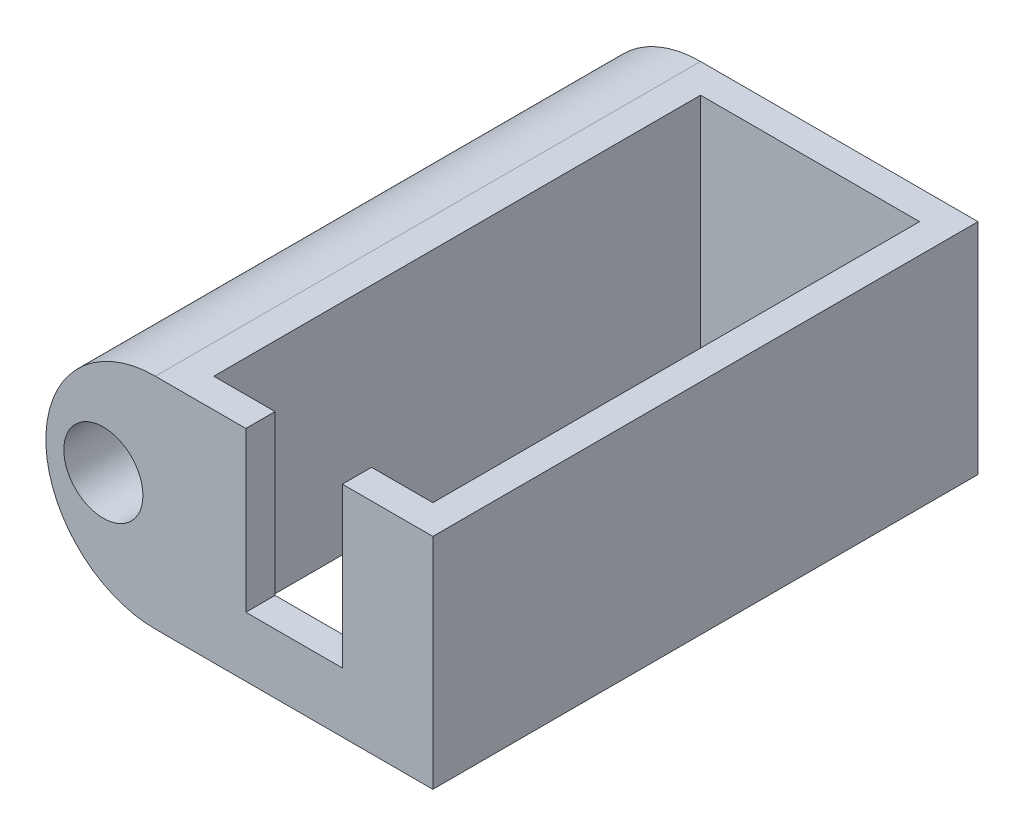
ISO-10303-21;
HEADER;
FILE_DESCRIPTION(('STEP AP214'),'2;1');
FILE_NAME('part.step','',(''),(''),'','','');
FILE_SCHEMA(('AUTOMOTIVE_DESIGN { 1 0 10303 214 1 1 1 1 }'));
ENDSEC;
DATA;
#1=APPLICATION_CONTEXT('core data for automotive mechanical design processes');
#2=APPLICATION_PROTOCOL_DEFINITION('international standard','automotive_design',2000,#1);
#3=PRODUCT_CONTEXT('',#1,'mechanical');
#4=PRODUCT('Part','Part','',(#3));
#5=PRODUCT_RELATED_PRODUCT_CATEGORY('part','',(#4));
#6=PRODUCT_DEFINITION_FORMATION('','',#4);
#7=PRODUCT_DEFINITION_CONTEXT('part definition',#1,'design');
#8=PRODUCT_DEFINITION('design','',#6,#7);
#9=PRODUCT_DEFINITION_SHAPE('','',#8);
#10=(LENGTH_UNIT() NAMED_UNIT(*) SI_UNIT(.MILLI.,.METRE.));
#11=(NAMED_UNIT(*) PLANE_ANGLE_UNIT() SI_UNIT($,.RADIAN.));
#12=(NAMED_UNIT(*) SI_UNIT($,.STERADIAN.) SOLID_ANGLE_UNIT());
#13=UNCERTAINTY_MEASURE_WITH_UNIT(LENGTH_MEASURE(1.E-05),#10,'distance_accuracy_value','');
#14=(GEOMETRIC_REPRESENTATION_CONTEXT(3) GLOBAL_UNCERTAINTY_ASSIGNED_CONTEXT((#13)) GLOBAL_UNIT_ASSIGNED_CONTEXT((#10,
#11,#12)) REPRESENTATION_CONTEXT('',''));
#15=CARTESIAN_POINT('',(0.,0.,0.));
#16=DIRECTION('',(0.,0.,1.));
#17=DIRECTION('',(1.,0.,0.));
#18=AXIS2_PLACEMENT_3D('',#15,#16,#17);
#19=CARTESIAN_POINT('',(-3.33764425359235,4.5,-20.2));
#20=DIRECTION('',(0.,0.,-1.));
#21=DIRECTION('',(-1.,0.,0.));
#22=AXIS2_PLACEMENT_3D('',#19,#20,#21);
#23=CYLINDRICAL_SURFACE('',#22,1.00193281875964);
#24=CARTESIAN_POINT('',(-3.33764425359235,4.5,-20.2));
#25=DIRECTION('',(0.,0.,-1.));
#26=DIRECTION('',(-1.,0.,0.));
#27=AXIS2_PLACEMENT_3D('',#24,#25,#26);
#28=CIRCLE('',#27,1.00193281875964);
#29=CARTESIAN_POINT('',(-4.33957707235199,4.5,-20.2));
#30=VERTEX_POINT('',#29);
#31=EDGE_CURVE('E60',#30,#30,#28,.T.);
#32=ORIENTED_EDGE('',*,*,#31,.F.);
#33=EDGE_LOOP('',(#32));
#34=FACE_BOUND('',#33,.T.);
#35=CARTESIAN_POINT('',(-3.33764425359235,4.5,-21.2));
#36=DIRECTION('',(0.,0.,-1.));
#37=DIRECTION('',(-1.,0.,0.));
#38=AXIS2_PLACEMENT_3D('',#35,#36,#37);
#39=CIRCLE('',#38,1.00193281875964);
#40=CARTESIAN_POINT('',(-4.33957707235199,4.5,-21.2));
#41=VERTEX_POINT('',#40);
#42=EDGE_CURVE('E66',#41,#41,#39,.T.);
#43=ORIENTED_EDGE('',*,*,#42,.T.);
#44=EDGE_LOOP('',(#43));
#45=FACE_BOUND('',#44,.T.);
#46=ADVANCED_FACE('F53',(#34,#45),#23,.F.);
#47=CARTESIAN_POINT('',(-3.33764425359235,4.5,-20.2));
#48=DIRECTION('',(0.,0.,-1.));
#49=DIRECTION('',(-1.,0.,0.));
#50=AXIS2_PLACEMENT_3D('',#47,#48,#49);
#51=CYLINDRICAL_SURFACE('',#50,1.55);
#52=CARTESIAN_POINT('',(-3.33764425359235,4.5,-20.2));
#53=DIRECTION('',(0.,0.,-1.));
#54=DIRECTION('',(-1.,0.,0.));
#55=AXIS2_PLACEMENT_3D('',#52,#53,#54);
#56=CIRCLE('',#55,1.55);
#57=CARTESIAN_POINT('',(-4.88764425359235,4.5,-20.2));
#58=VERTEX_POINT('',#57);
#59=EDGE_CURVE('E11',#58,#58,#56,.T.);
#60=ORIENTED_EDGE('',*,*,#59,.T.);
#61=EDGE_LOOP('',(#60));
#62=FACE_BOUND('',#61,.T.);
#63=CARTESIAN_POINT('',(-3.33764425359235,4.5,-21.2));
#64=DIRECTION('',(0.,0.,-1.));
#65=DIRECTION('',(-1.,0.,0.));
#66=AXIS2_PLACEMENT_3D('',#63,#64,#65);
#67=CIRCLE('',#66,1.55);
#68=CARTESIAN_POINT('',(-4.88764425359235,4.5,-21.2));
#69=VERTEX_POINT('',#68);
#70=EDGE_CURVE('E56',#69,#69,#67,.T.);
#71=ORIENTED_EDGE('',*,*,#70,.F.);
#72=EDGE_LOOP('',(#71));
#73=FACE_BOUND('',#72,.T.);
#74=ADVANCED_FACE('F75',(#62,#73),#51,.T.);
#75=CARTESIAN_POINT('',(0.,0.,-20.2));
#76=DIRECTION('',(0.,0.,-1.));
#77=DIRECTION('',(-1.,0.,0.));
#78=AXIS2_PLACEMENT_3D('',#75,#76,#77);
#79=PLANE('',#78);
#80=ORIENTED_EDGE('',*,*,#31,.T.);
#81=EDGE_LOOP('',(#80));
#82=FACE_BOUND('',#81,.T.);
#83=ORIENTED_EDGE('',*,*,#59,.F.);
#84=EDGE_LOOP('',(#83));
#85=FACE_BOUND('',#84,.T.);
#86=ADVANCED_FACE('F77',(#82,#85),#79,.F.);
#87=CARTESIAN_POINT('',(0.,0.,-21.2));
#88=DIRECTION('',(0.,0.,-1.));
#89=DIRECTION('',(-1.,0.,0.));
#90=AXIS2_PLACEMENT_3D('',#87,#88,#89);
#91=PLANE('',#90);
#92=ORIENTED_EDGE('',*,*,#42,.F.);
#93=EDGE_LOOP('',(#92));
#94=FACE_BOUND('',#93,.T.);
#95=ORIENTED_EDGE('',*,*,#70,.T.);
#96=EDGE_LOOP('',(#95));
#97=FACE_BOUND('',#96,.T.);
#98=ADVANCED_FACE('F73',(#94,#97),#91,.T.);
#99=CLOSED_SHELL('',(#46,#74,#86,#98));
#100=MANIFOLD_SOLID_BREP('B2',#99);
#101=CARTESIAN_POINT('',(0.,9.,1.2));
#102=DIRECTION('',(0.,0.,-1.));
#103=DIRECTION('',(-1.,0.,0.));
#104=AXIS2_PLACEMENT_3D('',#101,#102,#103);
#105=PLANE('',#104);
#106=DIRECTION('',(0.,-1.,0.));
#107=VECTOR('',#106,1.);
#108=CARTESIAN_POINT('',(6.48292097965606,0.,1.2));
#109=LINE('',#108,#107);
#110=CARTESIAN_POINT('',(6.48292097965606,9.,1.2));
#111=VERTEX_POINT('',#110);
#112=CARTESIAN_POINT('',(6.48292097965606,2.45931739238323,1.2));
#113=VERTEX_POINT('',#112);
#114=EDGE_CURVE('E328',#111,#113,#109,.T.);
#115=ORIENTED_EDGE('',*,*,#114,.T.);
#116=DIRECTION('',(1.,0.,0.));
#117=VECTOR('',#116,1.);
#118=CARTESIAN_POINT('',(0.,2.45931739238323,1.2));
#119=LINE('',#118,#117);
#120=CARTESIAN_POINT('',(2.51707902034396,2.45931739238323,1.2));
#121=VERTEX_POINT('',#120);
#122=EDGE_CURVE('E314',#121,#113,#119,.T.);
#123=ORIENTED_EDGE('',*,*,#122,.F.);
#124=DIRECTION('',(0.,-1.,0.));
#125=VECTOR('',#124,1.);
#126=CARTESIAN_POINT('',(2.51707902034396,0.,1.2));
#127=LINE('',#126,#125);
#128=CARTESIAN_POINT('',(2.51707902034396,9.,1.2));
#129=VERTEX_POINT('',#128);
#130=EDGE_CURVE('E310',#129,#121,#127,.T.);
#131=ORIENTED_EDGE('',*,*,#130,.F.);
#132=DIRECTION('',(1.,0.,0.));
#133=VECTOR('',#132,1.);
#134=CARTESIAN_POINT('',(0.,9.,1.2));
#135=LINE('',#134,#133);
#136=CARTESIAN_POINT('',(-1.2,9.,1.2));
#137=VERTEX_POINT('',#136);
#138=EDGE_CURVE('E255',#137,#129,#135,.T.);
#139=ORIENTED_EDGE('',*,*,#138,.F.);
#140=CARTESIAN_POINT('',(-1.2,4.5,1.2));
#141=DIRECTION('',(0.,0.,1.));
#142=DIRECTION('',(1.,0.,0.));
#143=AXIS2_PLACEMENT_3D('',#140,#141,#142);
#144=CIRCLE('',#143,4.5);
#145=CARTESIAN_POINT('',(-1.2,0.,1.2));
#146=VERTEX_POINT('',#145);
#147=EDGE_CURVE('E346',#137,#146,#144,.T.);
#148=ORIENTED_EDGE('',*,*,#147,.T.);
#149=DIRECTION('',(1.,0.,0.));
#150=VECTOR('',#149,1.);
#151=CARTESIAN_POINT('',(0.,0.,1.2));
#152=LINE('',#151,#150);
#153=CARTESIAN_POINT('',(10.2,0.,1.2));
#154=VERTEX_POINT('',#153);
#155=EDGE_CURVE('E280',#146,#154,#152,.T.);
#156=ORIENTED_EDGE('',*,*,#155,.T.);
#157=DIRECTION('',(0.,-1.,0.));
#158=VECTOR('',#157,1.);
#159=CARTESIAN_POINT('',(10.2,9.,1.2));
#160=LINE('',#159,#158);
#161=CARTESIAN_POINT('',(10.2,9.,1.2));
#162=VERTEX_POINT('',#161);
#163=EDGE_CURVE('E51',#162,#154,#160,.T.);
#164=ORIENTED_EDGE('',*,*,#163,.F.);
#165=EDGE_CURVE('E254',#111,#162,#135,.T.);
#166=ORIENTED_EDGE('',*,*,#165,.F.);
#167=EDGE_LOOP('',(#115,#123,#131,#139,#148,#156,#164,#166));
#168=FACE_BOUND('',#167,.T.);
#169=CARTESIAN_POINT('',(-3.33764425359235,4.5,1.2));
#170=DIRECTION('',(0.,0.,1.));
#171=DIRECTION('',(1.,0.,0.));
#172=AXIS2_PLACEMENT_3D('',#169,#170,#171);
#173=CIRCLE('',#172,1.625);
#174=CARTESIAN_POINT('',(-1.71264425359235,4.5,1.2));
#175=VERTEX_POINT('',#174);
#176=EDGE_CURVE('E340',#175,#175,#173,.T.);
#177=ORIENTED_EDGE('',*,*,#176,.F.);
#178=EDGE_LOOP('',(#177));
#179=FACE_BOUND('',#178,.T.);
#180=ADVANCED_FACE('F123',(#168,#179),#105,.F.);
#181=CARTESIAN_POINT('',(0.,9.,0.));
#182=DIRECTION('',(0.,0.,-1.));
#183=DIRECTION('',(-1.,0.,0.));
#184=AXIS2_PLACEMENT_3D('',#181,#182,#183);
#185=PLANE('',#184);
#186=DIRECTION('',(1.,0.,0.));
#187=VECTOR('',#186,1.);
#188=CARTESIAN_POINT('',(0.,2.45931739238323,0.));
#189=LINE('',#188,#187);
#190=CARTESIAN_POINT('',(2.51707902034396,2.45931739238323,0.));
#191=VERTEX_POINT('',#190);
#192=CARTESIAN_POINT('',(6.48292097965606,2.45931739238323,0.));
#193=VERTEX_POINT('',#192);
#194=EDGE_CURVE('E323',#191,#193,#189,.T.);
#195=ORIENTED_EDGE('',*,*,#194,.T.);
#196=DIRECTION('',(0.,-1.,0.));
#197=VECTOR('',#196,1.);
#198=CARTESIAN_POINT('',(6.48292097965606,0.,0.));
#199=LINE('',#198,#197);
#200=CARTESIAN_POINT('',(6.48292097965606,9.,0.));
#201=VERTEX_POINT('',#200);
#202=EDGE_CURVE('E268',#201,#193,#199,.T.);
#203=ORIENTED_EDGE('',*,*,#202,.F.);
#204=DIRECTION('',(1.,0.,0.));
#205=VECTOR('',#204,1.);
#206=CARTESIAN_POINT('',(0.,9.,0.));
#207=LINE('',#206,#205);
#208=CARTESIAN_POINT('',(9.00000000000001,9.,0.));
#209=VERTEX_POINT('',#208);
#210=EDGE_CURVE('E194',#201,#209,#207,.T.);
#211=ORIENTED_EDGE('',*,*,#210,.T.);
#212=DIRECTION('',(0.,-1.,0.));
#213=VECTOR('',#212,1.);
#214=CARTESIAN_POINT('',(9.00000000000001,9.,0.));
#215=LINE('',#214,#213);
#216=CARTESIAN_POINT('',(9.00000000000001,0.,0.));
#217=VERTEX_POINT('',#216);
#218=EDGE_CURVE('E233',#209,#217,#215,.T.);
#219=ORIENTED_EDGE('',*,*,#218,.T.);
#220=DIRECTION('',(1.,0.,0.));
#221=VECTOR('',#220,1.);
#222=CARTESIAN_POINT('',(0.,0.,0.));
#223=LINE('',#222,#221);
#224=CARTESIAN_POINT('',(0.,0.,0.));
#225=VERTEX_POINT('',#224);
#226=EDGE_CURVE('E267',#225,#217,#223,.T.);
#227=ORIENTED_EDGE('',*,*,#226,.F.);
#228=DIRECTION('',(0.,-1.,0.));
#229=VECTOR('',#228,1.);
#230=CARTESIAN_POINT('',(0.,9.,0.));
#231=LINE('',#230,#229);
#232=CARTESIAN_POINT('',(0.,9.,0.));
#233=VERTEX_POINT('',#232);
#234=EDGE_CURVE('E291',#233,#225,#231,.T.);
#235=ORIENTED_EDGE('',*,*,#234,.F.);
#236=CARTESIAN_POINT('',(2.51707902034396,9.,0.));
#237=VERTEX_POINT('',#236);
#238=EDGE_CURVE('E239',#233,#237,#207,.T.);
#239=ORIENTED_EDGE('',*,*,#238,.T.);
#240=DIRECTION('',(0.,-1.,0.));
#241=VECTOR('',#240,1.);
#242=CARTESIAN_POINT('',(2.51707902034396,0.,0.));
#243=LINE('',#242,#241);
#244=EDGE_CURVE('E146',#237,#191,#243,.T.);
#245=ORIENTED_EDGE('',*,*,#244,.T.);
#246=EDGE_LOOP('',(#195,#203,#211,#219,#227,#235,#239,#245));
#247=FACE_BOUND('',#246,.T.);
#248=ADVANCED_FACE('F296',(#247),#185,.T.);
#249=CARTESIAN_POINT('',(0.,9.,0.));
#250=DIRECTION('',(0.,1.,0.));
#251=DIRECTION('',(0.,0.,1.));
#252=AXIS2_PLACEMENT_3D('',#249,#250,#251);
#253=PLANE('',#252);
#254=ORIENTED_EDGE('',*,*,#210,.F.);
#255=DIRECTION('',(0.,0.,1.));
#256=VECTOR('',#255,1.);
#257=CARTESIAN_POINT('',(6.48292097965606,9.,-21.201));
#258=LINE('',#257,#256);
#259=EDGE_CURVE('E245',#201,#111,#258,.T.);
#260=ORIENTED_EDGE('',*,*,#259,.T.);
#261=ORIENTED_EDGE('',*,*,#165,.T.);
#262=DIRECTION('',(0.,0.,-1.));
#263=VECTOR('',#262,1.);
#264=CARTESIAN_POINT('',(10.2,9.,0.));
#265=LINE('',#264,#263);
#266=CARTESIAN_POINT('',(10.2,9.,-21.2));
#267=VERTEX_POINT('',#266);
#268=EDGE_CURVE('E155',#162,#267,#265,.T.);
#269=ORIENTED_EDGE('',*,*,#268,.T.);
#270=DIRECTION('',(1.,0.,0.));
#271=VECTOR('',#270,1.);
#272=CARTESIAN_POINT('',(0.,9.,-21.2));
#273=LINE('',#272,#271);
#274=CARTESIAN_POINT('',(-1.2,9.,-21.2));
#275=VERTEX_POINT('',#274);
#276=EDGE_CURVE('E231',#275,#267,#273,.T.);
#277=ORIENTED_EDGE('',*,*,#276,.F.);
#278=DIRECTION('',(0.,0.,-1.));
#279=VECTOR('',#278,1.);
#280=CARTESIAN_POINT('',(-1.2,9.,0.));
#281=LINE('',#280,#279);
#282=EDGE_CURVE('E219',#137,#275,#281,.T.);
#283=ORIENTED_EDGE('',*,*,#282,.F.);
#284=ORIENTED_EDGE('',*,*,#138,.T.);
#285=DIRECTION('',(0.,0.,1.));
#286=VECTOR('',#285,1.);
#287=CARTESIAN_POINT('',(2.51707902034396,9.,-21.201));
#288=LINE('',#287,#286);
#289=EDGE_CURVE('E303',#237,#129,#288,.T.);
#290=ORIENTED_EDGE('',*,*,#289,.F.);
#291=ORIENTED_EDGE('',*,*,#238,.F.);
#292=DIRECTION('',(0.,0.,-1.));
#293=VECTOR('',#292,1.);
#294=CARTESIAN_POINT('',(0.,9.,0.));
#295=LINE('',#294,#293);
#296=CARTESIAN_POINT('',(0.,9.,-20.));
#297=VERTEX_POINT('',#296);
#298=EDGE_CURVE('E214',#233,#297,#295,.T.);
#299=ORIENTED_EDGE('',*,*,#298,.T.);
#300=DIRECTION('',(1.,0.,0.));
#301=VECTOR('',#300,1.);
#302=CARTESIAN_POINT('',(0.,9.,-20.));
#303=LINE('',#302,#301);
#304=CARTESIAN_POINT('',(9.00000000000001,9.,-20.));
#305=VERTEX_POINT('',#304);
#306=EDGE_CURVE('E207',#297,#305,#303,.T.);
#307=ORIENTED_EDGE('',*,*,#306,.T.);
#308=DIRECTION('',(0.,0.,-1.));
#309=VECTOR('',#308,1.);
#310=CARTESIAN_POINT('',(9.00000000000001,9.,0.));
#311=LINE('',#310,#309);
#312=EDGE_CURVE('E211',#209,#305,#311,.T.);
#313=ORIENTED_EDGE('',*,*,#312,.F.);
#314=EDGE_LOOP('',(#254,#260,#261,#269,#277,#283,#284,#290,#291,#299,#307,#313));
#315=FACE_BOUND('',#314,.T.);
#316=ADVANCED_FACE('F209',(#315),#253,.T.);
#317=CARTESIAN_POINT('',(10.2,9.,0.));
#318=DIRECTION('',(-1.,0.,0.));
#319=DIRECTION('',(0.,0.,1.));
#320=AXIS2_PLACEMENT_3D('',#317,#318,#319);
#321=PLANE('',#320);
#322=DIRECTION('',(0.,0.,-1.));
#323=VECTOR('',#322,1.);
#324=CARTESIAN_POINT('',(10.2,0.,0.));
#325=LINE('',#324,#323);
#326=CARTESIAN_POINT('',(10.2,0.,-21.2));
#327=VERTEX_POINT('',#326);
#328=EDGE_CURVE('E242',#154,#327,#325,.T.);
#329=ORIENTED_EDGE('',*,*,#328,.T.);
#330=DIRECTION('',(0.,-1.,0.));
#331=VECTOR('',#330,1.);
#332=CARTESIAN_POINT('',(10.2,9.,-21.2));
#333=LINE('',#332,#331);
#334=EDGE_CURVE('E138',#267,#327,#333,.T.);
#335=ORIENTED_EDGE('',*,*,#334,.F.);
#336=ORIENTED_EDGE('',*,*,#268,.F.);
#337=ORIENTED_EDGE('',*,*,#163,.T.);
#338=EDGE_LOOP('',(#329,#335,#336,#337));
#339=FACE_BOUND('',#338,.T.);
#340=ADVANCED_FACE('F381',(#339),#321,.F.);
#341=CARTESIAN_POINT('',(9.00000000000001,9.,0.));
#342=DIRECTION('',(-1.,0.,0.));
#343=DIRECTION('',(0.,0.,1.));
#344=AXIS2_PLACEMENT_3D('',#341,#342,#343);
#345=PLANE('',#344);
#346=DIRECTION('',(0.,0.,-1.));
#347=VECTOR('',#346,1.);
#348=CARTESIAN_POINT('',(9.00000000000001,0.,0.));
#349=LINE('',#348,#347);
#350=CARTESIAN_POINT('',(9.00000000000001,0.,-20.));
#351=VERTEX_POINT('',#350);
#352=EDGE_CURVE('E264',#217,#351,#349,.T.);
#353=ORIENTED_EDGE('',*,*,#352,.F.);
#354=ORIENTED_EDGE('',*,*,#218,.F.);
#355=ORIENTED_EDGE('',*,*,#312,.T.);
#356=DIRECTION('',(0.,-1.,0.));
#357=VECTOR('',#356,1.);
#358=CARTESIAN_POINT('',(9.00000000000001,9.,-20.));
#359=LINE('',#358,#357);
#360=EDGE_CURVE('E222',#305,#351,#359,.T.);
#361=ORIENTED_EDGE('',*,*,#360,.T.);
#362=EDGE_LOOP('',(#353,#354,#355,#361));
#363=FACE_BOUND('',#362,.T.);
#364=ADVANCED_FACE('F125',(#363),#345,.T.);
#365=CARTESIAN_POINT('',(0.,9.,0.));
#366=DIRECTION('',(-1.,0.,0.));
#367=DIRECTION('',(0.,0.,1.));
#368=AXIS2_PLACEMENT_3D('',#365,#366,#367);
#369=PLANE('',#368);
#370=DIRECTION('',(0.,0.,-1.));
#371=VECTOR('',#370,1.);
#372=CARTESIAN_POINT('',(0.,0.,0.));
#373=LINE('',#372,#371);
#374=CARTESIAN_POINT('',(0.,0.,-20.));
#375=VERTEX_POINT('',#374);
#376=EDGE_CURVE('E272',#225,#375,#373,.T.);
#377=ORIENTED_EDGE('',*,*,#376,.T.);
#378=DIRECTION('',(0.,-1.,0.));
#379=VECTOR('',#378,1.);
#380=CARTESIAN_POINT('',(0.,9.,-20.));
#381=LINE('',#380,#379);
#382=EDGE_CURVE('E230',#297,#375,#381,.T.);
#383=ORIENTED_EDGE('',*,*,#382,.F.);
#384=ORIENTED_EDGE('',*,*,#298,.F.);
#385=ORIENTED_EDGE('',*,*,#234,.T.);
#386=EDGE_LOOP('',(#377,#383,#384,#385));
#387=FACE_BOUND('',#386,.T.);
#388=ADVANCED_FACE('F302',(#387),#369,.F.);
#389=CARTESIAN_POINT('',(0.,9.,-20.));
#390=DIRECTION('',(0.,0.,-1.));
#391=DIRECTION('',(-1.,0.,0.));
#392=AXIS2_PLACEMENT_3D('',#389,#390,#391);
#393=PLANE('',#392);
#394=DIRECTION('',(1.,0.,0.));
#395=VECTOR('',#394,1.);
#396=CARTESIAN_POINT('',(0.,0.,-20.));
#397=LINE('',#396,#395);
#398=EDGE_CURVE('E225',#375,#351,#397,.T.);
#399=ORIENTED_EDGE('',*,*,#398,.T.);
#400=ORIENTED_EDGE('',*,*,#360,.F.);
#401=ORIENTED_EDGE('',*,*,#306,.F.);
#402=ORIENTED_EDGE('',*,*,#382,.T.);
#403=EDGE_LOOP('',(#399,#400,#401,#402));
#404=FACE_BOUND('',#403,.T.);
#405=ADVANCED_FACE('F223',(#404),#393,.F.);
#406=CARTESIAN_POINT('',(0.,9.,-21.2));
#407=DIRECTION('',(0.,0.,-1.));
#408=DIRECTION('',(-1.,0.,0.));
#409=AXIS2_PLACEMENT_3D('',#406,#407,#408);
#410=PLANE('',#409);
#411=DIRECTION('',(1.,0.,0.));
#412=VECTOR('',#411,1.);
#413=CARTESIAN_POINT('',(0.,0.,-21.2));
#414=LINE('',#413,#412);
#415=CARTESIAN_POINT('',(-1.2,0.,-21.2));
#416=VERTEX_POINT('',#415);
#417=EDGE_CURVE('E235',#416,#327,#414,.T.);
#418=ORIENTED_EDGE('',*,*,#417,.F.);
#419=CARTESIAN_POINT('',(-1.2,4.5,-21.2));
#420=DIRECTION('',(0.,0.,-1.));
#421=DIRECTION('',(-1.,0.,0.));
#422=AXIS2_PLACEMENT_3D('',#419,#420,#421);
#423=CIRCLE('',#422,4.5);
#424=EDGE_CURVE('E186',#275,#416,#423,.F.);
#425=ORIENTED_EDGE('',*,*,#424,.F.);
#426=ORIENTED_EDGE('',*,*,#276,.T.);
#427=ORIENTED_EDGE('',*,*,#334,.T.);
#428=EDGE_LOOP('',(#418,#425,#426,#427));
#429=FACE_BOUND('',#428,.T.);
#430=CARTESIAN_POINT('',(-3.33764425359235,4.5,-21.2));
#431=DIRECTION('',(0.,0.,-1.));
#432=DIRECTION('',(-1.,0.,0.));
#433=AXIS2_PLACEMENT_3D('',#430,#431,#432);
#434=CIRCLE('',#433,1.625);
#435=CARTESIAN_POINT('',(-4.96264425359235,4.5,-21.2));
#436=VERTEX_POINT('',#435);
#437=EDGE_CURVE('E342',#436,#436,#434,.F.);
#438=ORIENTED_EDGE('',*,*,#437,.T.);
#439=EDGE_LOOP('',(#438));
#440=FACE_BOUND('',#439,.T.);
#441=ADVANCED_FACE('F385',(#429,#440),#410,.T.);
#442=CARTESIAN_POINT('',(0.,0.,0.));
#443=DIRECTION('',(0.,1.,0.));
#444=DIRECTION('',(0.,0.,1.));
#445=AXIS2_PLACEMENT_3D('',#442,#443,#444);
#446=PLANE('',#445);
#447=ORIENTED_EDGE('',*,*,#352,.T.);
#448=ORIENTED_EDGE('',*,*,#398,.F.);
#449=ORIENTED_EDGE('',*,*,#376,.F.);
#450=ORIENTED_EDGE('',*,*,#226,.T.);
#451=EDGE_LOOP('',(#447,#448,#449,#450));
#452=FACE_BOUND('',#451,.T.);
#453=DIRECTION('',(0.,0.,-1.));
#454=VECTOR('',#453,1.);
#455=CARTESIAN_POINT('',(-1.2,0.,0.));
#456=LINE('',#455,#454);
#457=EDGE_CURVE('E277',#146,#416,#456,.T.);
#458=ORIENTED_EDGE('',*,*,#457,.T.);
#459=ORIENTED_EDGE('',*,*,#417,.T.);
#460=ORIENTED_EDGE('',*,*,#328,.F.);
#461=ORIENTED_EDGE('',*,*,#155,.F.);
#462=EDGE_LOOP('',(#458,#459,#460,#461));
#463=FACE_BOUND('',#462,.T.);
#464=ADVANCED_FACE('F299',(#452,#463),#446,.F.);
#465=CARTESIAN_POINT('',(6.48292097965606,0.,-21.201));
#466=DIRECTION('',(-1.,0.,0.));
#467=DIRECTION('',(0.,0.,1.));
#468=AXIS2_PLACEMENT_3D('',#465,#466,#467);
#469=PLANE('',#468);
#470=ORIENTED_EDGE('',*,*,#202,.T.);
#471=DIRECTION('',(0.,0.,1.));
#472=VECTOR('',#471,1.);
#473=CARTESIAN_POINT('',(6.48292097965606,2.45931739238323,-21.201));
#474=LINE('',#473,#472);
#475=EDGE_CURVE('E319',#193,#113,#474,.T.);
#476=ORIENTED_EDGE('',*,*,#475,.T.);
#477=ORIENTED_EDGE('',*,*,#114,.F.);
#478=ORIENTED_EDGE('',*,*,#259,.F.);
#479=EDGE_LOOP('',(#470,#476,#477,#478));
#480=FACE_BOUND('',#479,.T.);
#481=ADVANCED_FACE('F430',(#480),#469,.T.);
#482=CARTESIAN_POINT('',(0.,2.45931739238323,-21.201));
#483=DIRECTION('',(0.,-1.,0.));
#484=DIRECTION('',(0.,0.,-1.));
#485=AXIS2_PLACEMENT_3D('',#482,#483,#484);
#486=PLANE('',#485);
#487=DIRECTION('',(0.,0.,1.));
#488=VECTOR('',#487,1.);
#489=CARTESIAN_POINT('',(2.51707902034396,2.45931739238323,-21.201));
#490=LINE('',#489,#488);
#491=EDGE_CURVE('E311',#191,#121,#490,.T.);
#492=ORIENTED_EDGE('',*,*,#491,.T.);
#493=ORIENTED_EDGE('',*,*,#122,.T.);
#494=ORIENTED_EDGE('',*,*,#475,.F.);
#495=ORIENTED_EDGE('',*,*,#194,.F.);
#496=EDGE_LOOP('',(#492,#493,#494,#495));
#497=FACE_BOUND('',#496,.T.);
#498=ADVANCED_FACE('F423',(#497),#486,.F.);
#499=CARTESIAN_POINT('',(2.51707902034396,0.,-21.201));
#500=DIRECTION('',(-1.,0.,0.));
#501=DIRECTION('',(0.,0.,1.));
#502=AXIS2_PLACEMENT_3D('',#499,#500,#501);
#503=PLANE('',#502);
#504=ORIENTED_EDGE('',*,*,#289,.T.);
#505=ORIENTED_EDGE('',*,*,#130,.T.);
#506=ORIENTED_EDGE('',*,*,#491,.F.);
#507=ORIENTED_EDGE('',*,*,#244,.F.);
#508=EDGE_LOOP('',(#504,#505,#506,#507));
#509=FACE_BOUND('',#508,.T.);
#510=ADVANCED_FACE('F424',(#509),#503,.F.);
#511=CARTESIAN_POINT('',(-1.2,4.5,-31.2623058987491));
#512=DIRECTION('',(0.,0.,1.));
#513=DIRECTION('',(1.,0.,0.));
#514=AXIS2_PLACEMENT_3D('',#511,#512,#513);
#515=CYLINDRICAL_SURFACE('',#514,4.5);
#516=CARTESIAN_POINT('',(-5.7,4.5,-10.8991765716971));
#517=CARTESIAN_POINT('',(-5.69999898109126,4.44455976161218,-10.8991747098572));
#518=CARTESIAN_POINT('',(-5.69896506997846,4.38909721736519,-10.8945505808654));
#519=CARTESIAN_POINT('',(-5.69494048878835,4.27974902794843,-10.8761963355218));
#520=CARTESIAN_POINT('',(-5.69194845108674,4.22586451243051,-10.8624598546925));
#521=CARTESIAN_POINT('',(-5.68434056584504,4.12126836111924,-10.8263335864513));
#522=CARTESIAN_POINT('',(-5.67972644219541,4.07055342394986,-10.8039529831982));
#523=CARTESIAN_POINT('',(-5.66937167720689,3.97359990984312,-10.7512032654609));
#524=CARTESIAN_POINT('',(-5.66363105773679,3.92736124603333,-10.7208343060518));
#525=CARTESIAN_POINT('',(-5.65154547087105,3.83990684299298,-10.6524387391438));
#526=CARTESIAN_POINT('',(-5.64519280820714,3.79877569397823,-10.6143053206296));
#527=CARTESIAN_POINT('',(-5.63265300539893,3.72343754477081,-10.5316925416506));
#528=CARTESIAN_POINT('',(-5.62646588044024,3.68923117794572,-10.4872126013419));
#529=CARTESIAN_POINT('',(-5.61488164130856,3.62833778294825,-10.392540649668));
#530=CARTESIAN_POINT('',(-5.60949437871491,3.60174128947798,-10.3422890926764));
#531=CARTESIAN_POINT('',(-5.60023048176198,3.55740350522746,-10.2378901908509));
#532=CARTESIAN_POINT('',(-5.59635366052386,3.53966111889952,-10.183743328945));
#533=CARTESIAN_POINT('',(-5.59062804729594,3.51381570996798,-10.0740098330358));
#534=CARTESIAN_POINT('',(-5.58874772903892,3.50556266480965,-10.0184602141444));
#535=CARTESIAN_POINT('',(-5.58713336865335,3.49846364501163,-9.90673546280403));
#536=CARTESIAN_POINT('',(-5.58739905389469,3.49961647544168,-9.85056041071605));
#537=CARTESIAN_POINT('',(-5.59001816074073,3.51117586241349,-9.74029825810022));
#538=CARTESIAN_POINT('',(-5.59233215692421,3.52140767769891,-9.68619175962745));
#539=CARTESIAN_POINT('',(-5.59872477095838,3.55055754659427,-9.58048300003462));
#540=CARTESIAN_POINT('',(-5.60280349066588,3.56947610159174,-9.52888088365442));
#541=CARTESIAN_POINT('',(-5.61230454985148,3.61562163563563,-9.42915685250618));
#542=CARTESIAN_POINT('',(-5.61773762181245,3.64291540310324,-9.38106690802909));
#543=CARTESIAN_POINT('',(-5.62932868955372,3.70498965930075,-9.29008513643918));
#544=CARTESIAN_POINT('',(-5.63548678710299,3.73977119962863,-9.24719404078705));
#545=CARTESIAN_POINT('',(-5.64800287306333,3.81675658148509,-9.16682191702289));
#546=CARTESIAN_POINT('',(-5.65436225343936,3.85910889736688,-9.1294831791446));
#547=CARTESIAN_POINT('',(-5.66643919561159,3.94954669095419,-9.06241470724357));
#548=CARTESIAN_POINT('',(-5.67215674504213,3.99763227908131,-9.03268511980618));
#549=CARTESIAN_POINT('',(-5.68232532116804,4.09834840463263,-8.98164193380872));
#550=CARTESIAN_POINT('',(-5.6867734650383,4.15098893884007,-8.960347449543));
#551=CARTESIAN_POINT('',(-5.69388068183128,4.25922203450927,-8.92694606516819));
#552=CARTESIAN_POINT('',(-5.69654002348392,4.31481415120332,-8.91483778499006));
#553=CARTESIAN_POINT('',(-5.69973158880836,4.42615225835958,-8.90036056506954));
#554=CARTESIAN_POINT('',(-5.70030624311145,4.48187180134055,-8.89779732161628));
#555=CARTESIAN_POINT('',(-5.69938279325299,4.59294296196404,-8.90195562382731));
#556=CARTESIAN_POINT('',(-5.6978848344523,4.64829460513532,-8.90867651835685));
#557=CARTESIAN_POINT('',(-5.69301129379307,4.75641162866471,-8.93105127928118));
#558=CARTESIAN_POINT('',(-5.6896572350388,4.80919924585774,-8.94660279980885));
#559=CARTESIAN_POINT('',(-5.68144710543397,4.91141640292792,-8.98608341541966));
#560=CARTESIAN_POINT('',(-5.6765909038233,4.96084565000509,-9.01001323985013));
#561=CARTESIAN_POINT('',(-5.6658107661382,5.05574321994719,-9.06597301009662));
#562=CARTESIAN_POINT('',(-5.65987222295124,5.10114286541612,-9.09811654320021));
#563=CARTESIAN_POINT('',(-5.6476151617454,5.18597348249406,-9.16944219624784));
#564=CARTESIAN_POINT('',(-5.64129659275087,5.22540365086706,-9.20862526186317));
#565=CARTESIAN_POINT('',(-5.62884439472905,5.29794774095493,-9.29381058848748));
#566=CARTESIAN_POINT('',(-5.62271658832142,5.33092690970037,-9.33992861670043));
#567=CARTESIAN_POINT('',(-5.61147697689154,5.38867305961376,-9.43716258890253));
#568=CARTESIAN_POINT('',(-5.60636512747635,5.41344039963487,-9.48827831436818));
#569=CARTESIAN_POINT('',(-5.59778600274463,5.4538900094813,-9.59378071624969));
#570=CARTESIAN_POINT('',(-5.59430939829893,5.4696239317738,-9.64814679283154));
#571=CARTESIAN_POINT('',(-5.58937824848696,5.49171013829203,-9.75883866412836));
#572=CARTESIAN_POINT('',(-5.58792336773666,5.49806397859178,-9.81516413221011));
#573=CARTESIAN_POINT('',(-5.58722200724489,5.50114178320522,-9.92681601083629));
#574=CARTESIAN_POINT('',(-5.58792649185062,5.49807956571967,-9.98213632572716));
#575=CARTESIAN_POINT('',(-5.59135332478774,5.48289138560844,-10.0914514266805));
#576=CARTESIAN_POINT('',(-5.59407564773517,5.4707655370012,-10.1454462294089));
#577=CARTESIAN_POINT('',(-5.60120714065762,5.43789909990372,-10.2504011318108));
#578=CARTESIAN_POINT('',(-5.60561002591385,5.41719058314227,-10.3013717301379));
#579=CARTESIAN_POINT('',(-5.61560882234529,5.36777385174171,-10.3991465679705));
#580=CARTESIAN_POINT('',(-5.62120486238316,5.33906477292597,-10.4459503566791));
#581=CARTESIAN_POINT('',(-5.63310521417665,5.27375679495279,-10.5351148761711));
#582=CARTESIAN_POINT('',(-5.6394218568387,5.23700592755519,-10.5773626741585));
#583=CARTESIAN_POINT('',(-5.65196987086694,5.15696435297252,-10.6551616086628));
#584=CARTESIAN_POINT('',(-5.65820122214526,5.11367213311672,-10.6907111919513));
#585=CARTESIAN_POINT('',(-5.66997629863291,5.02107298532278,-10.7545645631571));
#586=CARTESIAN_POINT('',(-5.67550961749614,4.97169281831747,-10.7827641715646));
#587=CARTESIAN_POINT('',(-5.68516029184624,4.86878013988941,-10.8304182237877));
#588=CARTESIAN_POINT('',(-5.68927881635408,4.8152511016565,-10.8498798917202));
#589=CARTESIAN_POINT('',(-5.69491406454777,4.7180691238647,-10.8760972468355));
#590=CARTESIAN_POINT('',(-5.69680934511605,4.67493599595084,-10.8847352585303));
#591=CARTESIAN_POINT('',(-5.69935268729895,4.58787322494726,-10.8962755238502));
#592=CARTESIAN_POINT('',(-5.70000080761807,4.54394361944644,-10.8991780474481));
#593=CARTESIAN_POINT('',(-5.7,4.5,-10.8991765716971));
#594=B_SPLINE_CURVE_WITH_KNOTS('',3,(#516,#517,#518,#519,#520,#521,#522,#523,#524,#525,#526,
#527,#528,#529,#530,#531,#532,#533,#534,#535,#536,#537,#538,#539,#540,#541,#542,#543,#544,#545,
#546,#547,#548,#549,#550,#551,#552,#553,#554,#555,#556,#557,#558,#559,#560,#561,#562,#563,#564,
#565,#566,#567,#568,#569,#570,#571,#572,#573,#574,#575,#576,#577,#578,#579,#580,#581,#582,#583,
#584,#585,#586,#587,#588,#589,#590,#591,#592,#593),.UNSPECIFIED.,.T.,.F.,(4,2,2,2,2,2,2,2,2,2,2,
2,2,2,2,2,2,2,2,2,2,2,2,2,2,2,2,2,2,2,2,2,2,2,2,2,2,2,4),(0.,0.166159844864899,
0.332435865624642,0.49853570620373,0.664632322584947,0.833190360010398,1.00176380745257,
1.17226648148988,1.3427480534387,1.51049562819054,1.67822189248296,1.84278834072892,
2.0073642887347,2.17328834854791,2.3392357262915,2.50889089904489,2.67854933984914,
2.84859006405619,3.01860523750994,3.18513996062135,3.35166300456134,3.51629434712584,
3.6809400247273,3.84799901631021,4.01508046693879,4.18534736552865,4.35560682255206,
4.52488279527622,4.69413068343206,4.85956392571209,5.0249950869143,5.1898135600789,
5.35464984293194,5.52292163156413,5.69123239233206,5.86181293524785,6.03225218935468,
6.16396173679279,6.29566508443976),.UNSPECIFIED.);
#595=CARTESIAN_POINT('',(-5.7,4.5,-10.8991765716971));
#596=VERTEX_POINT('',#595);
#597=EDGE_CURVE('E341',#596,#596,#594,.T.);
#598=ORIENTED_EDGE('',*,*,#597,.F.);
#599=EDGE_LOOP('',(#598));
#600=FACE_BOUND('',#599,.T.);
#601=ORIENTED_EDGE('',*,*,#282,.T.);
#602=ORIENTED_EDGE('',*,*,#424,.T.);
#603=ORIENTED_EDGE('',*,*,#457,.F.);
#604=ORIENTED_EDGE('',*,*,#147,.F.);
#605=EDGE_LOOP('',(#601,#602,#603,#604));
#606=FACE_BOUND('',#605,.T.);
#607=ADVANCED_FACE('F359',(#600,#606),#515,.T.);
#608=CARTESIAN_POINT('',(-3.33764425359235,4.5,-31.2623058987491));
#609=DIRECTION('',(0.,0.,1.));
#610=DIRECTION('',(1.,0.,0.));
#611=AXIS2_PLACEMENT_3D('',#608,#609,#610);
#612=CYLINDRICAL_SURFACE('',#611,1.625);
#613=CARTESIAN_POINT('',(-4.96264425359235,4.5,-10.8991765716971));
#614=CARTESIAN_POINT('',(-4.96264120700192,4.44905815133431,-10.8991732770239));
#615=CARTESIAN_POINT('',(-4.96022334734054,4.39804763038155,-10.8952572609478));
#616=CARTESIAN_POINT('',(-4.95078100603759,4.29757922558547,-10.8797994591033));
#617=CARTESIAN_POINT('',(-4.94374672541706,4.2481248794585,-10.8682414517817));
#618=CARTESIAN_POINT('',(-4.92578076159735,4.15242754915871,-10.8381637526788));
#619=CARTESIAN_POINT('',(-4.91486840846456,4.10616997279593,-10.8196785646416));
#620=CARTESIAN_POINT('',(-4.89006287535953,4.01756745829785,-10.7764965692121));
#621=CARTESIAN_POINT('',(-4.87617017975783,3.97522188597469,-10.7518007710669));
#622=CARTESIAN_POINT('',(-4.84527236656345,3.89188059749125,-10.6947507614847));
#623=CARTESIAN_POINT('',(-4.82810845313834,3.85125248566768,-10.6619472172901));
#624=CARTESIAN_POINT('',(-4.79290354206557,3.77571687236726,-10.5906366044337));
#625=CARTESIAN_POINT('',(-4.77486140789873,3.74081705368191,-10.5521220056895));
#626=CARTESIAN_POINT('',(-4.73712705326595,3.67310125181866,-10.4645871168165));
#627=CARTESIAN_POINT('',(-4.71752659290504,3.64115095545946,-10.4148517718859));
#628=CARTESIAN_POINT('',(-4.68174761910905,3.58616693195737,-10.3095673363112));
#629=CARTESIAN_POINT('',(-4.66556342360328,3.56311834528719,-10.2540281326759));
#630=CARTESIAN_POINT('',(-4.64273775949291,3.53168496235124,-10.1529785678522));
#631=CARTESIAN_POINT('',(-4.63471868211258,3.52106724063211,-10.1084757630307));
#632=CARTESIAN_POINT('',(-4.62322152263894,3.50601355168385,-10.0178862455102));
#633=CARTESIAN_POINT('',(-4.61973733175821,3.50156926788774,-9.971801749576));
#634=CARTESIAN_POINT('',(-4.617830742579,3.49912499672213,-9.8792447274987));
#635=CARTESIAN_POINT('',(-4.6194202469842,3.50114016303305,-9.83277154438321));
#636=CARTESIAN_POINT('',(-4.62743545528761,3.51151433180551,-9.7409533550272));
#637=CARTESIAN_POINT('',(-4.63386494943729,3.51987830613432,-9.69560926175494));
#638=CARTESIAN_POINT('',(-4.65049022500364,3.54226944805557,-9.60804266540073));
#639=CARTESIAN_POINT('',(-4.66061295850416,3.55618723727545,-9.56577751370213));
#640=CARTESIAN_POINT('',(-4.68352137648753,3.58915323863041,-9.48408511436476));
#641=CARTESIAN_POINT('',(-4.69630801445864,3.60820328846731,-9.44465888967765));
#642=CARTESIAN_POINT('',(-4.72591925332674,3.65488908294822,-9.36212238300634));
#643=CARTESIAN_POINT('',(-4.74305501926907,3.68345693950599,-9.31965099255049));
#644=CARTESIAN_POINT('',(-4.7778888851488,3.74659230703652,-9.23964822236772));
#645=CARTESIAN_POINT('',(-4.79558753437292,3.78116583511506,-9.20212186404046));
#646=CARTESIAN_POINT('',(-4.83277311585491,3.8616662805191,-9.12716452314384));
#647=CARTESIAN_POINT('',(-4.8521129373024,3.9085221845395,-9.09064699049704));
#648=CARTESIAN_POINT('',(-4.88755470068706,4.00885112583428,-9.02606425983157));
#649=CARTESIAN_POINT('',(-4.90365811379517,4.06232113860143,-8.99799521848981));
#650=CARTESIAN_POINT('',(-4.92998853307731,4.17133340988249,-8.95300106222223));
#651=CARTESIAN_POINT('',(-4.94050219842265,4.22657560615379,-8.93552402490004));
#652=CARTESIAN_POINT('',(-4.95575456820977,4.33999214890332,-8.91035977971872));
#653=CARTESIAN_POINT('',(-4.96050094958789,4.39816248995473,-8.90265955714895));
#654=CARTESIAN_POINT('',(-4.96340481089368,4.50668755609848,-8.89794107749593));
#655=CARTESIAN_POINT('',(-4.96241047376042,4.55696525971301,-8.89954785180642));
#656=CARTESIAN_POINT('',(-4.95586573991413,4.65641406421929,-8.91022055255318));
#657=CARTESIAN_POINT('',(-4.95031556024494,4.70558521771327,-8.9192861236467));
#658=CARTESIAN_POINT('',(-4.93543241570403,4.79983765519472,-8.94398299407685));
#659=CARTESIAN_POINT('',(-4.92623088673683,4.84500047053448,-8.95938678532147));
#660=CARTESIAN_POINT('',(-4.90479270972834,4.93206841134661,-8.99609795432933));
#661=CARTESIAN_POINT('',(-4.89255552192757,4.97397295573541,-9.01740638205347));
#662=CARTESIAN_POINT('',(-4.86454833939962,5.05798279905183,-9.06773625704016));
#663=CARTESIAN_POINT('',(-4.84854497854261,5.09966988276453,-9.09732383108376));
#664=CARTESIAN_POINT('',(-4.81515368024963,5.17779040021947,-9.16216764415487));
#665=CARTESIAN_POINT('',(-4.79776417759591,5.21421776047325,-9.19743033858048));
#666=CARTESIAN_POINT('',(-4.7605319086046,5.28604705185969,-9.27832844850741));
#667=CARTESIAN_POINT('',(-4.74068577207502,5.32059492433971,-9.32472473795269));
#668=CARTESIAN_POINT('',(-4.70324728327101,5.38149419296048,-9.42344144729076));
#669=CARTESIAN_POINT('',(-4.6856530384536,5.4078524987612,-9.47575682203912));
#670=CARTESIAN_POINT('',(-4.65856358823997,5.44669679424283,-9.57372670483696));
#671=CARTESIAN_POINT('',(-4.64814141956173,5.46094218165036,-9.61842384890982));
#672=CARTESIAN_POINT('',(-4.63161101168391,5.483091682936,-9.71010767707059));
#673=CARTESIAN_POINT('',(-4.62549629168018,5.4910053257348,-9.75709080739795));
#674=CARTESIAN_POINT('',(-4.61848633436846,5.50005232169362,-9.85234574793442));
#675=CARTESIAN_POINT('',(-4.61761675657494,5.50115234295853,-9.90062273475647));
#676=CARTESIAN_POINT('',(-4.62131788333001,5.49640078645795,-9.99663185674421));
#677=CARTESIAN_POINT('',(-4.62589094381597,5.49054619827506,-10.0443637469235));
#678=CARTESIAN_POINT('',(-4.63926034122584,5.47289773283612,-10.1346435848759));
#679=CARTESIAN_POINT('',(-4.64775081626004,5.46153136961433,-10.1773239821168));
#680=CARTESIAN_POINT('',(-4.66780280066362,5.43359399641853,-10.2601690901903));
#681=CARTESIAN_POINT('',(-4.67936552022435,5.4170209349978,-10.3003328019507));
#682=CARTESIAN_POINT('',(-4.70635808685158,5.3763146455064,-10.3834518708876));
#683=CARTESIAN_POINT('',(-4.72210749179281,5.35142251797083,-10.4259302002538));
#684=CARTESIAN_POINT('',(-4.75473208777433,5.29594252717682,-10.5065254132832));
#685=CARTESIAN_POINT('',(-4.7716082001367,5.26534996507562,-10.5446386566729));
#686=CARTESIAN_POINT('',(-4.80825412294763,5.19273012152235,-10.6226861545665));
#687=CARTESIAN_POINT('',(-4.82798235123212,5.14963447171638,-10.6616553221559));
#688=CARTESIAN_POINT('',(-4.86514444551679,5.05666236405105,-10.7319557755505));
#689=CARTESIAN_POINT('',(-4.88257713859073,5.00678246597043,-10.7632831636286));
#690=CARTESIAN_POINT('',(-4.9131085092618,4.90185503411806,-10.8167485111802));
#691=CARTESIAN_POINT('',(-4.92625551568689,4.84687480137402,-10.8389897140879));
#692=CARTESIAN_POINT('',(-4.94689007114441,4.7329616328409,-10.8734663208412));
#693=CARTESIAN_POINT('',(-4.95439819874544,4.67404393259061,-10.8857381206361));
#694=CARTESIAN_POINT('',(-4.95995284292462,4.59542804932084,-10.8947976195469));
#695=CARTESIAN_POINT('',(-4.96095975795067,4.57639724853531,-10.8964372288078));
#696=CARTESIAN_POINT('',(-4.96230605439631,4.53824752940612,-10.8986273546443));
#697=CARTESIAN_POINT('',(-4.96264539758359,4.51912860607847,-10.8991778088432));
#698=CARTESIAN_POINT('',(-4.96264425359235,4.5,-10.8991765716971));
#699=B_SPLINE_CURVE_WITH_KNOTS('',3,(#613,#614,#615,#616,#617,#618,#619,#620,#621,#622,#623,
#624,#625,#626,#627,#628,#629,#630,#631,#632,#633,#634,#635,#636,#637,#638,#639,#640,#641,#642,
#643,#644,#645,#646,#647,#648,#649,#650,#651,#652,#653,#654,#655,#656,#657,#658,#659,#660,#661,
#662,#663,#664,#665,#666,#667,#668,#669,#670,#671,#672,#673,#674,#675,#676,#677,#678,#679,#680,
#681,#682,#683,#684,#685,#686,#687,#688,#689,#690,#691,#692,#693,#694,#695,#696,#697,#698),
.UNSPECIFIED.,.T.,.F.,(4,2,2,2,2,2,2,2,2,2,2,2,2,2,2,2,2,2,2,2,2,2,2,2,2,2,2,2,2,2,2,2,2,2,2,2,
2,2,2,2,2,2,4),(0.,0.152744622226995,0.30581451884238,0.458131906964542,0.610424558923167,
0.774685442437911,0.939164863738462,1.12509993751201,1.31072327635627,1.44948838884151,
1.58806638155937,1.72696971190526,1.86598193234902,2.00238178870399,2.13883055063932,
2.30015688290633,2.46164579087261,2.64812546194486,2.83452017244859,3.01010401527963,
3.18545387832525,3.3356271372828,3.48579324228609,3.6309836072235,3.77619980645942,
3.93627525060895,4.09653408308111,4.27917945171801,4.46167029861499,4.60525986912854,
4.74863293677429,4.89270682791237,5.03684310654279,5.17125153454929,5.30571298622822,
5.46022835283182,5.61487165376563,5.79809307288122,5.98140775048173,6.16257730978959,
6.34308245113028,6.40043459808033,6.45779002953237),.UNSPECIFIED.);
#700=CARTESIAN_POINT('',(-4.96264425359235,4.5,-10.8991765716971));
#701=VERTEX_POINT('',#700);
#702=EDGE_CURVE('E127',#701,#701,#699,.T.);
#703=ORIENTED_EDGE('',*,*,#702,.T.);
#704=EDGE_LOOP('',(#703));
#705=FACE_BOUND('',#704,.T.);
#706=ORIENTED_EDGE('',*,*,#176,.T.);
#707=EDGE_LOOP('',(#706));
#708=FACE_BOUND('',#707,.T.);
#709=ORIENTED_EDGE('',*,*,#437,.F.);
#710=EDGE_LOOP('',(#709));
#711=FACE_BOUND('',#710,.T.);
#712=ADVANCED_FACE('F364',(#705,#708,#711),#612,.F.);
#713=CARTESIAN_POINT('',(-14.,4.5,-9.89917657169713));
#714=DIRECTION('',(1.,0.,0.));
#715=DIRECTION('',(0.,0.,-1.));
#716=AXIS2_PLACEMENT_3D('',#713,#714,#715);
#717=CYLINDRICAL_SURFACE('',#716,1.);
#718=ORIENTED_EDGE('',*,*,#597,.T.);
#719=EDGE_LOOP('',(#718));
#720=FACE_BOUND('',#719,.T.);
#721=ORIENTED_EDGE('',*,*,#702,.F.);
#722=EDGE_LOOP('',(#721));
#723=FACE_BOUND('',#722,.T.);
#724=ADVANCED_FACE('F361',(#720,#723),#717,.F.);
#725=CLOSED_SHELL('',(#180,#248,#316,#340,#364,#388,#405,#441,#464,#481,#498,#510,#607,#712,#724));
#726=MANIFOLD_SOLID_BREP('B6',#725);
#727=ADVANCED_BREP_SHAPE_REPRESENTATION('',(#18,#100,#726),#14);
#728=SHAPE_DEFINITION_REPRESENTATION(#9,#727);
ENDSEC;
END-ISO-10303-21;
